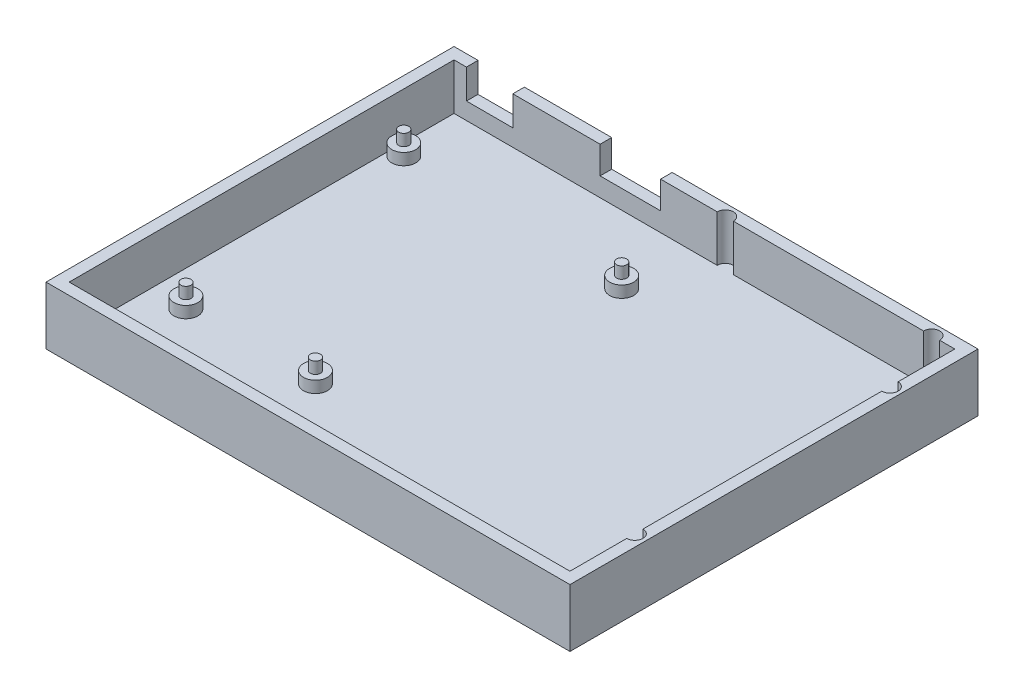
ISO-10303-21;
HEADER;
FILE_DESCRIPTION(('STEP AP214'),'2;1');
FILE_NAME('part.step','',(''),(''),'','','');
FILE_SCHEMA(('AUTOMOTIVE_DESIGN { 1 0 10303 214 1 1 1 1 }'));
ENDSEC;
DATA;
#1=APPLICATION_CONTEXT('core data for automotive mechanical design processes');
#2=APPLICATION_PROTOCOL_DEFINITION('international standard','automotive_design',2000,#1);
#3=PRODUCT_CONTEXT('',#1,'mechanical');
#4=PRODUCT('Part','Part','',(#3));
#5=PRODUCT_RELATED_PRODUCT_CATEGORY('part','',(#4));
#6=PRODUCT_DEFINITION_FORMATION('','',#4);
#7=PRODUCT_DEFINITION_CONTEXT('part definition',#1,'design');
#8=PRODUCT_DEFINITION('design','',#6,#7);
#9=PRODUCT_DEFINITION_SHAPE('','',#8);
#10=(LENGTH_UNIT() NAMED_UNIT(*) SI_UNIT(.MILLI.,.METRE.));
#11=(NAMED_UNIT(*) PLANE_ANGLE_UNIT() SI_UNIT($,.RADIAN.));
#12=(NAMED_UNIT(*) SI_UNIT($,.STERADIAN.) SOLID_ANGLE_UNIT());
#13=UNCERTAINTY_MEASURE_WITH_UNIT(LENGTH_MEASURE(1.E-05),#10,'distance_accuracy_value','');
#14=(GEOMETRIC_REPRESENTATION_CONTEXT(3) GLOBAL_UNCERTAINTY_ASSIGNED_CONTEXT((#13)) GLOBAL_UNIT_ASSIGNED_CONTEXT((#10,
#11,#12)) REPRESENTATION_CONTEXT('',''));
#15=CARTESIAN_POINT('',(0.,0.,0.));
#16=DIRECTION('',(0.,0.,1.));
#17=DIRECTION('',(1.,0.,0.));
#18=AXIS2_PLACEMENT_3D('',#15,#16,#17);
#19=CARTESIAN_POINT('',(108.,165.723601407031,0.));
#20=DIRECTION('',(-1.,0.,0.));
#21=DIRECTION('',(0.,0.,1.));
#22=AXIS2_PLACEMENT_3D('',#19,#20,#21);
#23=PLANE('',#22);
#24=DIRECTION('',(0.,1.,0.));
#25=VECTOR('',#24,1.);
#26=CARTESIAN_POINT('',(108.,-1.41311896062464,-12.25));
#27=LINE('',#26,#25);
#28=CARTESIAN_POINT('',(108.,2.5,-12.25));
#29=VERTEX_POINT('',#28);
#30=CARTESIAN_POINT('',(108.,12.5,-12.25));
#31=VERTEX_POINT('',#30);
#32=EDGE_CURVE('E466',#29,#31,#27,.T.);
#33=ORIENTED_EDGE('',*,*,#32,.F.);
#34=DIRECTION('',(0.,0.,-1.));
#35=VECTOR('',#34,1.);
#36=CARTESIAN_POINT('',(108.,2.5,0.));
#37=LINE('',#36,#35);
#38=CARTESIAN_POINT('',(108.,2.5,0.));
#39=VERTEX_POINT('',#38);
#40=EDGE_CURVE('E247',#39,#29,#37,.T.);
#41=ORIENTED_EDGE('',*,*,#40,.F.);
#42=DIRECTION('',(0.,-1.,0.));
#43=VECTOR('',#42,1.);
#44=CARTESIAN_POINT('',(108.,165.723601407031,0.));
#45=LINE('',#44,#43);
#46=CARTESIAN_POINT('',(108.,12.5,0.));
#47=VERTEX_POINT('',#46);
#48=EDGE_CURVE('E377',#47,#39,#45,.T.);
#49=ORIENTED_EDGE('',*,*,#48,.F.);
#50=DIRECTION('',(0.,0.,1.));
#51=VECTOR('',#50,1.);
#52=CARTESIAN_POINT('',(108.,12.5,0.));
#53=LINE('',#52,#51);
#54=EDGE_CURVE('E389',#31,#47,#53,.T.);
#55=ORIENTED_EDGE('',*,*,#54,.F.);
#56=EDGE_LOOP('',(#33,#41,#49,#55));
#57=FACE_BOUND('',#56,.T.);
#58=ADVANCED_FACE('F38',(#57),#23,.T.);
#59=DIRECTION('',(0.,1.,0.));
#60=VECTOR('',#59,1.);
#61=CARTESIAN_POINT('',(108.,-1.41311896062464,-15.75));
#62=LINE('',#61,#60);
#63=CARTESIAN_POINT('',(108.,2.5,-15.75));
#64=VERTEX_POINT('',#63);
#65=CARTESIAN_POINT('',(108.,12.5,-15.75));
#66=VERTEX_POINT('',#65);
#67=EDGE_CURVE('E456',#64,#66,#62,.T.);
#68=ORIENTED_EDGE('',*,*,#67,.T.);
#69=CARTESIAN_POINT('',(108.,12.5,-67.25));
#70=VERTEX_POINT('',#69);
#71=EDGE_CURVE('E397',#70,#66,#53,.T.);
#72=ORIENTED_EDGE('',*,*,#71,.F.);
#73=DIRECTION('',(0.,1.,0.));
#74=VECTOR('',#73,1.);
#75=CARTESIAN_POINT('',(108.,-1.41311896062464,-67.25));
#76=LINE('',#75,#74);
#77=CARTESIAN_POINT('',(108.,2.5,-67.25));
#78=VERTEX_POINT('',#77);
#79=EDGE_CURVE('E455',#78,#70,#76,.T.);
#80=ORIENTED_EDGE('',*,*,#79,.F.);
#81=EDGE_CURVE('E251',#64,#78,#37,.T.);
#82=ORIENTED_EDGE('',*,*,#81,.F.);
#83=EDGE_LOOP('',(#68,#72,#80,#82));
#84=FACE_BOUND('',#83,.T.);
#85=ADVANCED_FACE('F495',(#84),#23,.T.);
#86=CARTESIAN_POINT('',(0.,165.723601407031,-83.));
#87=DIRECTION('',(0.,0.,-1.));
#88=DIRECTION('',(-1.,0.,0.));
#89=AXIS2_PLACEMENT_3D('',#86,#87,#88);
#90=PLANE('',#89);
#91=DIRECTION('',(1.,0.,0.));
#92=VECTOR('',#91,1.);
#93=CARTESIAN_POINT('',(0.,2.5,-83.));
#94=LINE('',#93,#92);
#95=CARTESIAN_POINT('',(0.,2.5,-83.));
#96=VERTEX_POINT('',#95);
#97=CARTESIAN_POINT('',(56.75,2.5,-83.));
#98=VERTEX_POINT('',#97);
#99=EDGE_CURVE('E232',#96,#98,#94,.T.);
#100=ORIENTED_EDGE('',*,*,#99,.T.);
#101=DIRECTION('',(0.,1.,0.));
#102=VECTOR('',#101,1.);
#103=CARTESIAN_POINT('',(56.75,-1.41311896062464,-83.));
#104=LINE('',#103,#102);
#105=CARTESIAN_POINT('',(56.75,12.5,-83.));
#106=VERTEX_POINT('',#105);
#107=EDGE_CURVE('E63',#98,#106,#104,.T.);
#108=ORIENTED_EDGE('',*,*,#107,.T.);
#109=DIRECTION('',(-1.,0.,0.));
#110=VECTOR('',#109,1.);
#111=CARTESIAN_POINT('',(0.,12.5,-83.));
#112=LINE('',#111,#110);
#113=CARTESIAN_POINT('',(44.5399999999999,12.5,-83.));
#114=VERTEX_POINT('',#113);
#115=EDGE_CURVE('E404',#106,#114,#112,.T.);
#116=ORIENTED_EDGE('',*,*,#115,.T.);
#117=DIRECTION('',(0.,1.,0.));
#118=VECTOR('',#117,1.);
#119=CARTESIAN_POINT('',(44.5399999999999,12.5,-83.));
#120=LINE('',#119,#118);
#121=CARTESIAN_POINT('',(44.5399999999999,6.58000000000003,-83.));
#122=VERTEX_POINT('',#121);
#123=EDGE_CURVE('E351',#122,#114,#120,.T.);
#124=ORIENTED_EDGE('',*,*,#123,.F.);
#125=DIRECTION('',(1.,0.,0.));
#126=VECTOR('',#125,1.);
#127=CARTESIAN_POINT('',(44.5399999999999,6.58000000000003,-83.));
#128=LINE('',#127,#126);
#129=CARTESIAN_POINT('',(31.4999999999999,6.58000000000003,-83.));
#130=VERTEX_POINT('',#129);
#131=EDGE_CURVE('E354',#130,#122,#128,.T.);
#132=ORIENTED_EDGE('',*,*,#131,.F.);
#133=DIRECTION('',(0.,-1.,0.));
#134=VECTOR('',#133,1.);
#135=CARTESIAN_POINT('',(31.4999999999999,6.58000000000003,-83.));
#136=LINE('',#135,#134);
#137=CARTESIAN_POINT('',(31.4999999999999,12.5,-83.));
#138=VERTEX_POINT('',#137);
#139=EDGE_CURVE('E336',#138,#130,#136,.T.);
#140=ORIENTED_EDGE('',*,*,#139,.F.);
#141=CARTESIAN_POINT('',(12.6749999999999,12.5,-83.));
#142=VERTEX_POINT('',#141);
#143=EDGE_CURVE('E405',#138,#142,#112,.T.);
#144=ORIENTED_EDGE('',*,*,#143,.T.);
#145=DIRECTION('',(0.,1.,0.));
#146=VECTOR('',#145,1.);
#147=CARTESIAN_POINT('',(12.6749999999999,12.5,-83.));
#148=LINE('',#147,#146);
#149=CARTESIAN_POINT('',(12.6749999999999,6.15000000000005,-83.));
#150=VERTEX_POINT('',#149);
#151=EDGE_CURVE('E331',#150,#142,#148,.T.);
#152=ORIENTED_EDGE('',*,*,#151,.F.);
#153=DIRECTION('',(1.,0.,0.));
#154=VECTOR('',#153,1.);
#155=CARTESIAN_POINT('',(12.6749999999999,6.15000000000005,-83.));
#156=LINE('',#155,#154);
#157=CARTESIAN_POINT('',(2.67499999999987,6.15000000000005,-83.));
#158=VERTEX_POINT('',#157);
#159=EDGE_CURVE('E326',#158,#150,#156,.T.);
#160=ORIENTED_EDGE('',*,*,#159,.F.);
#161=DIRECTION('',(0.,-1.,0.));
#162=VECTOR('',#161,1.);
#163=CARTESIAN_POINT('',(2.67499999999987,6.15000000000005,-83.));
#164=LINE('',#163,#162);
#165=CARTESIAN_POINT('',(2.67499999999987,12.5,-83.));
#166=VERTEX_POINT('',#165);
#167=EDGE_CURVE('E328',#166,#158,#164,.T.);
#168=ORIENTED_EDGE('',*,*,#167,.F.);
#169=CARTESIAN_POINT('',(0.,12.5,-83.));
#170=VERTEX_POINT('',#169);
#171=EDGE_CURVE('E385',#166,#170,#112,.T.);
#172=ORIENTED_EDGE('',*,*,#171,.T.);
#173=DIRECTION('',(0.,-1.,0.));
#174=VECTOR('',#173,1.);
#175=CARTESIAN_POINT('',(0.,165.723601407031,-83.));
#176=LINE('',#175,#174);
#177=EDGE_CURVE('E386',#170,#96,#176,.T.);
#178=ORIENTED_EDGE('',*,*,#177,.T.);
#179=EDGE_LOOP('',(#100,#108,#116,#124,#132,#140,#144,#152,#160,#168,#172,#178));
#180=FACE_BOUND('',#179,.T.);
#181=ADVANCED_FACE('F440',(#180),#90,.F.);
#182=CARTESIAN_POINT('',(101.25,12.5,-83.));
#183=VERTEX_POINT('',#182);
#184=CARTESIAN_POINT('',(60.25,12.5,-83.));
#185=VERTEX_POINT('',#184);
#186=EDGE_CURVE('E225',#183,#185,#112,.T.);
#187=ORIENTED_EDGE('',*,*,#186,.T.);
#188=DIRECTION('',(0.,1.,0.));
#189=VECTOR('',#188,1.);
#190=CARTESIAN_POINT('',(60.25,-1.41311896062464,-83.));
#191=LINE('',#190,#189);
#192=CARTESIAN_POINT('',(60.25,2.5,-83.));
#193=VERTEX_POINT('',#192);
#194=EDGE_CURVE('E212',#193,#185,#191,.T.);
#195=ORIENTED_EDGE('',*,*,#194,.F.);
#196=CARTESIAN_POINT('',(101.25,2.5,-83.));
#197=VERTEX_POINT('',#196);
#198=EDGE_CURVE('E223',#193,#197,#94,.T.);
#199=ORIENTED_EDGE('',*,*,#198,.T.);
#200=DIRECTION('',(0.,1.,0.));
#201=VECTOR('',#200,1.);
#202=CARTESIAN_POINT('',(101.25,-1.41311896062464,-83.));
#203=LINE('',#202,#201);
#204=EDGE_CURVE('E55',#197,#183,#203,.T.);
#205=ORIENTED_EDGE('',*,*,#204,.T.);
#206=EDGE_LOOP('',(#187,#195,#199,#205));
#207=FACE_BOUND('',#206,.T.);
#208=ADVANCED_FACE('F222',(#207),#90,.F.);
#209=CARTESIAN_POINT('',(0.,165.723601407031,0.));
#210=DIRECTION('',(-1.,0.,0.));
#211=DIRECTION('',(0.,0.,1.));
#212=AXIS2_PLACEMENT_3D('',#209,#210,#211);
#213=PLANE('',#212);
#214=DIRECTION('',(0.,-1.,0.));
#215=VECTOR('',#214,1.);
#216=CARTESIAN_POINT('',(0.,5.,-70.118514184194));
#217=LINE('',#216,#215);
#218=CARTESIAN_POINT('',(0.,2.5,-70.118514184194));
#219=VERTEX_POINT('',#218);
#220=CARTESIAN_POINT('',(0.,5.,-70.118514184194));
#221=VERTEX_POINT('',#220);
#222=EDGE_CURVE('E313',#219,#221,#217,.F.);
#223=ORIENTED_EDGE('',*,*,#222,.F.);
#224=DIRECTION('',(0.,0.,-1.));
#225=VECTOR('',#224,1.);
#226=CARTESIAN_POINT('',(0.,2.5,0.));
#227=LINE('',#226,#225);
#228=EDGE_CURVE('E235',#219,#96,#227,.T.);
#229=ORIENTED_EDGE('',*,*,#228,.T.);
#230=ORIENTED_EDGE('',*,*,#177,.F.);
#231=DIRECTION('',(0.,0.,1.));
#232=VECTOR('',#231,1.);
#233=CARTESIAN_POINT('',(0.,12.5,0.));
#234=LINE('',#233,#232);
#235=CARTESIAN_POINT('',(0.,12.5,0.));
#236=VERTEX_POINT('',#235);
#237=EDGE_CURVE('E380',#170,#236,#234,.T.);
#238=ORIENTED_EDGE('',*,*,#237,.T.);
#239=DIRECTION('',(0.,-1.,0.));
#240=VECTOR('',#239,1.);
#241=CARTESIAN_POINT('',(0.,165.723601407031,0.));
#242=LINE('',#241,#240);
#243=CARTESIAN_POINT('',(0.,2.5,0.));
#244=VERTEX_POINT('',#243);
#245=EDGE_CURVE('E382',#236,#244,#242,.T.);
#246=ORIENTED_EDGE('',*,*,#245,.T.);
#247=CARTESIAN_POINT('',(0.,2.5,-69.1314858158061));
#248=VERTEX_POINT('',#247);
#249=EDGE_CURVE('E241',#244,#248,#227,.T.);
#250=ORIENTED_EDGE('',*,*,#249,.T.);
#251=DIRECTION('',(0.,-1.,0.));
#252=VECTOR('',#251,1.);
#253=CARTESIAN_POINT('',(0.,5.,-69.1314858158061));
#254=LINE('',#253,#252);
#255=CARTESIAN_POINT('',(0.,5.,-69.1314858158061));
#256=VERTEX_POINT('',#255);
#257=EDGE_CURVE('E310',#256,#248,#254,.T.);
#258=ORIENTED_EDGE('',*,*,#257,.F.);
#259=DIRECTION('',(0.,0.,-1.));
#260=VECTOR('',#259,1.);
#261=CARTESIAN_POINT('',(0.,5.,0.));
#262=LINE('',#261,#260);
#263=EDGE_CURVE('E12',#256,#221,#262,.T.);
#264=ORIENTED_EDGE('',*,*,#263,.T.);
#265=EDGE_LOOP('',(#223,#229,#230,#238,#246,#250,#258,#264));
#266=FACE_BOUND('',#265,.T.);
#267=ADVANCED_FACE('F447',(#266),#213,.F.);
#268=CARTESIAN_POINT('',(0.,12.5,0.));
#269=DIRECTION('',(0.,-1.,0.));
#270=DIRECTION('',(0.,0.,-1.));
#271=AXIS2_PLACEMENT_3D('',#268,#269,#270);
#272=PLANE('',#271);
#273=ORIENTED_EDGE('',*,*,#71,.T.);
#274=CARTESIAN_POINT('',(108.,12.5,-14.));
#275=DIRECTION('',(0.,1.,0.));
#276=DIRECTION('',(0.,0.,-1.));
#277=AXIS2_PLACEMENT_3D('',#274,#275,#276);
#278=CIRCLE('',#277,1.75);
#279=EDGE_CURVE('E464',#31,#66,#278,.T.);
#280=ORIENTED_EDGE('',*,*,#279,.F.);
#281=ORIENTED_EDGE('',*,*,#54,.T.);
#282=DIRECTION('',(-1.,0.,0.));
#283=VECTOR('',#282,1.);
#284=CARTESIAN_POINT('',(0.,12.5,0.));
#285=LINE('',#284,#283);
#286=EDGE_CURVE('E396',#47,#236,#285,.T.);
#287=ORIENTED_EDGE('',*,*,#286,.T.);
#288=ORIENTED_EDGE('',*,*,#237,.F.);
#289=ORIENTED_EDGE('',*,*,#171,.F.);
#290=DIRECTION('',(0.,0.,-1.));
#291=VECTOR('',#290,1.);
#292=CARTESIAN_POINT('',(2.67499999999987,12.5,-68.6791061731469));
#293=LINE('',#292,#291);
#294=CARTESIAN_POINT('',(2.67499999999987,12.5,-85.5));
#295=VERTEX_POINT('',#294);
#296=EDGE_CURVE('E329',#166,#295,#293,.T.);
#297=ORIENTED_EDGE('',*,*,#296,.T.);
#298=DIRECTION('',(-1.,0.,0.));
#299=VECTOR('',#298,1.);
#300=CARTESIAN_POINT('',(0.,12.5,-85.5));
#301=LINE('',#300,#299);
#302=CARTESIAN_POINT('',(-2.5,12.5,-85.5));
#303=VERTEX_POINT('',#302);
#304=EDGE_CURVE('E376',#295,#303,#301,.T.);
#305=ORIENTED_EDGE('',*,*,#304,.T.);
#306=DIRECTION('',(0.,0.,1.));
#307=VECTOR('',#306,1.);
#308=CARTESIAN_POINT('',(-2.5,12.5,0.));
#309=LINE('',#308,#307);
#310=CARTESIAN_POINT('',(-2.5,12.5,2.5));
#311=VERTEX_POINT('',#310);
#312=EDGE_CURVE('E399',#303,#311,#309,.T.);
#313=ORIENTED_EDGE('',*,*,#312,.T.);
#314=DIRECTION('',(-1.,0.,0.));
#315=VECTOR('',#314,1.);
#316=CARTESIAN_POINT('',(0.,12.5,2.5));
#317=LINE('',#316,#315);
#318=CARTESIAN_POINT('',(110.5,12.5,2.5));
#319=VERTEX_POINT('',#318);
#320=EDGE_CURVE('E350',#319,#311,#317,.T.);
#321=ORIENTED_EDGE('',*,*,#320,.F.);
#322=DIRECTION('',(0.,0.,1.));
#323=VECTOR('',#322,1.);
#324=CARTESIAN_POINT('',(110.5,12.5,0.));
#325=LINE('',#324,#323);
#326=CARTESIAN_POINT('',(110.5,12.5,-85.5));
#327=VERTEX_POINT('',#326);
#328=EDGE_CURVE('E239',#327,#319,#325,.T.);
#329=ORIENTED_EDGE('',*,*,#328,.F.);
#330=CARTESIAN_POINT('',(44.5399999999999,12.5,-85.5));
#331=VERTEX_POINT('',#330);
#332=EDGE_CURVE('E236',#327,#331,#301,.T.);
#333=ORIENTED_EDGE('',*,*,#332,.T.);
#334=DIRECTION('',(0.,0.,-1.));
#335=VECTOR('',#334,1.);
#336=CARTESIAN_POINT('',(44.5399999999999,12.5,-68.6791061731469));
#337=LINE('',#336,#335);
#338=EDGE_CURVE('E366',#114,#331,#337,.T.);
#339=ORIENTED_EDGE('',*,*,#338,.F.);
#340=ORIENTED_EDGE('',*,*,#115,.F.);
#341=CARTESIAN_POINT('',(58.5,12.5,-83.));
#342=DIRECTION('',(0.,1.,0.));
#343=DIRECTION('',(0.,0.,-1.));
#344=AXIS2_PLACEMENT_3D('',#341,#342,#343);
#345=CIRCLE('',#344,1.75);
#346=EDGE_CURVE('E226',#185,#106,#345,.T.);
#347=ORIENTED_EDGE('',*,*,#346,.F.);
#348=ORIENTED_EDGE('',*,*,#186,.F.);
#349=CARTESIAN_POINT('',(103.,12.5,-83.));
#350=DIRECTION('',(0.,1.,0.));
#351=DIRECTION('',(0.,0.,-1.));
#352=AXIS2_PLACEMENT_3D('',#349,#350,#351);
#353=CIRCLE('',#352,1.75);
#354=CARTESIAN_POINT('',(104.75,12.5,-83.));
#355=VERTEX_POINT('',#354);
#356=EDGE_CURVE('E448',#355,#183,#353,.T.);
#357=ORIENTED_EDGE('',*,*,#356,.F.);
#358=CARTESIAN_POINT('',(108.,12.5,-83.));
#359=VERTEX_POINT('',#358);
#360=EDGE_CURVE('E390',#359,#355,#112,.T.);
#361=ORIENTED_EDGE('',*,*,#360,.F.);
#362=CARTESIAN_POINT('',(108.,12.5,-70.75));
#363=VERTEX_POINT('',#362);
#364=EDGE_CURVE('E393',#359,#363,#53,.T.);
#365=ORIENTED_EDGE('',*,*,#364,.T.);
#366=CARTESIAN_POINT('',(108.,12.5,-69.));
#367=DIRECTION('',(0.,1.,0.));
#368=DIRECTION('',(0.,0.,-1.));
#369=AXIS2_PLACEMENT_3D('',#366,#367,#368);
#370=CIRCLE('',#369,1.75);
#371=EDGE_CURVE('E453',#70,#363,#370,.T.);
#372=ORIENTED_EDGE('',*,*,#371,.F.);
#373=EDGE_LOOP('',(#273,#280,#281,#287,#288,#289,#297,#305,#313,#321,#329,#333,#339,#340,#347,
#348,#357,#361,#365,#372));
#374=FACE_BOUND('',#373,.T.);
#375=ADVANCED_FACE('F418',(#374),#272,.F.);
#376=CARTESIAN_POINT('',(-2.5,2.5,2.5));
#377=DIRECTION('',(-1.,0.,0.));
#378=DIRECTION('',(0.,0.,1.));
#379=AXIS2_PLACEMENT_3D('',#376,#377,#378);
#380=PLANE('',#379);
#381=DIRECTION('',(0.,0.,-1.));
#382=VECTOR('',#381,1.);
#383=CARTESIAN_POINT('',(-2.5,0.,2.5));
#384=LINE('',#383,#382);
#385=CARTESIAN_POINT('',(-2.5,0.,2.5));
#386=VERTEX_POINT('',#385);
#387=CARTESIAN_POINT('',(-2.5,0.,-85.5));
#388=VERTEX_POINT('',#387);
#389=EDGE_CURVE('E250',#386,#388,#384,.T.);
#390=ORIENTED_EDGE('',*,*,#389,.F.);
#391=DIRECTION('',(0.,-1.,0.));
#392=VECTOR('',#391,1.);
#393=CARTESIAN_POINT('',(-2.5,2.5,2.5));
#394=LINE('',#393,#392);
#395=EDGE_CURVE('E263',#311,#386,#394,.T.);
#396=ORIENTED_EDGE('',*,*,#395,.F.);
#397=ORIENTED_EDGE('',*,*,#312,.F.);
#398=DIRECTION('',(0.,-1.,0.));
#399=VECTOR('',#398,1.);
#400=CARTESIAN_POINT('',(-2.5,2.5,-85.5));
#401=LINE('',#400,#399);
#402=EDGE_CURVE('E262',#303,#388,#401,.T.);
#403=ORIENTED_EDGE('',*,*,#402,.T.);
#404=EDGE_LOOP('',(#390,#396,#397,#403));
#405=FACE_BOUND('',#404,.T.);
#406=ADVANCED_FACE('F40',(#405),#380,.T.);
#407=CARTESIAN_POINT('',(-2.5,2.5,2.5));
#408=DIRECTION('',(0.,0.,-1.));
#409=DIRECTION('',(-1.,0.,0.));
#410=AXIS2_PLACEMENT_3D('',#407,#408,#409);
#411=PLANE('',#410);
#412=DIRECTION('',(1.,0.,0.));
#413=VECTOR('',#412,1.);
#414=CARTESIAN_POINT('',(-2.5,0.,2.5));
#415=LINE('',#414,#413);
#416=CARTESIAN_POINT('',(110.5,0.,2.5));
#417=VERTEX_POINT('',#416);
#418=EDGE_CURVE('E260',#386,#417,#415,.T.);
#419=ORIENTED_EDGE('',*,*,#418,.T.);
#420=DIRECTION('',(0.,-1.,0.));
#421=VECTOR('',#420,1.);
#422=CARTESIAN_POINT('',(110.5,2.5,2.5));
#423=LINE('',#422,#421);
#424=EDGE_CURVE('E266',#319,#417,#423,.T.);
#425=ORIENTED_EDGE('',*,*,#424,.F.);
#426=ORIENTED_EDGE('',*,*,#320,.T.);
#427=ORIENTED_EDGE('',*,*,#395,.T.);
#428=EDGE_LOOP('',(#419,#425,#426,#427));
#429=FACE_BOUND('',#428,.T.);
#430=ADVANCED_FACE('F833',(#429),#411,.F.);
#431=CARTESIAN_POINT('',(110.5,2.5,2.5));
#432=DIRECTION('',(-1.,0.,0.));
#433=DIRECTION('',(0.,0.,1.));
#434=AXIS2_PLACEMENT_3D('',#431,#432,#433);
#435=PLANE('',#434);
#436=DIRECTION('',(0.,0.,-1.));
#437=VECTOR('',#436,1.);
#438=CARTESIAN_POINT('',(110.5,0.,2.5));
#439=LINE('',#438,#437);
#440=CARTESIAN_POINT('',(110.5,0.,-85.5));
#441=VERTEX_POINT('',#440);
#442=EDGE_CURVE('E257',#417,#441,#439,.T.);
#443=ORIENTED_EDGE('',*,*,#442,.T.);
#444=DIRECTION('',(0.,-1.,0.));
#445=VECTOR('',#444,1.);
#446=CARTESIAN_POINT('',(110.5,2.5,-85.5));
#447=LINE('',#446,#445);
#448=EDGE_CURVE('E269',#327,#441,#447,.T.);
#449=ORIENTED_EDGE('',*,*,#448,.F.);
#450=ORIENTED_EDGE('',*,*,#328,.T.);
#451=ORIENTED_EDGE('',*,*,#424,.T.);
#452=EDGE_LOOP('',(#443,#449,#450,#451));
#453=FACE_BOUND('',#452,.T.);
#454=ADVANCED_FACE('F413',(#453),#435,.F.);
#455=CARTESIAN_POINT('',(-2.5,2.5,-85.5));
#456=DIRECTION('',(0.,0.,-1.));
#457=DIRECTION('',(-1.,0.,0.));
#458=AXIS2_PLACEMENT_3D('',#455,#456,#457);
#459=PLANE('',#458);
#460=DIRECTION('',(0.,1.,0.));
#461=VECTOR('',#460,1.);
#462=CARTESIAN_POINT('',(2.67499999999987,6.15000000000005,-85.5));
#463=LINE('',#462,#461);
#464=CARTESIAN_POINT('',(2.67499999999987,6.15000000000005,-85.5));
#465=VERTEX_POINT('',#464);
#466=EDGE_CURVE('E339',#465,#295,#463,.T.);
#467=ORIENTED_EDGE('',*,*,#466,.F.);
#468=DIRECTION('',(-1.,0.,0.));
#469=VECTOR('',#468,1.);
#470=CARTESIAN_POINT('',(12.6749999999999,6.15000000000005,-85.5));
#471=LINE('',#470,#469);
#472=CARTESIAN_POINT('',(12.6749999999999,6.15000000000005,-85.5));
#473=VERTEX_POINT('',#472);
#474=EDGE_CURVE('E335',#473,#465,#471,.T.);
#475=ORIENTED_EDGE('',*,*,#474,.F.);
#476=DIRECTION('',(0.,-1.,0.));
#477=VECTOR('',#476,1.);
#478=CARTESIAN_POINT('',(12.6749999999999,12.5,-85.5));
#479=LINE('',#478,#477);
#480=CARTESIAN_POINT('',(12.6749999999999,12.5,-85.5));
#481=VERTEX_POINT('',#480);
#482=EDGE_CURVE('E332',#481,#473,#479,.T.);
#483=ORIENTED_EDGE('',*,*,#482,.F.);
#484=CARTESIAN_POINT('',(31.4999999999999,12.5,-85.5));
#485=VERTEX_POINT('',#484);
#486=EDGE_CURVE('E375',#485,#481,#301,.T.);
#487=ORIENTED_EDGE('',*,*,#486,.F.);
#488=DIRECTION('',(0.,1.,0.));
#489=VECTOR('',#488,1.);
#490=CARTESIAN_POINT('',(31.4999999999999,6.58000000000003,-85.5));
#491=LINE('',#490,#489);
#492=CARTESIAN_POINT('',(31.4999999999999,6.58000000000003,-85.5));
#493=VERTEX_POINT('',#492);
#494=EDGE_CURVE('E359',#493,#485,#491,.T.);
#495=ORIENTED_EDGE('',*,*,#494,.F.);
#496=DIRECTION('',(-1.,0.,0.));
#497=VECTOR('',#496,1.);
#498=CARTESIAN_POINT('',(44.5399999999999,6.58000000000003,-85.5));
#499=LINE('',#498,#497);
#500=CARTESIAN_POINT('',(44.5399999999999,6.58000000000003,-85.5));
#501=VERTEX_POINT('',#500);
#502=EDGE_CURVE('E325',#501,#493,#499,.T.);
#503=ORIENTED_EDGE('',*,*,#502,.F.);
#504=DIRECTION('',(0.,-1.,0.));
#505=VECTOR('',#504,1.);
#506=CARTESIAN_POINT('',(44.5399999999999,12.5,-85.5));
#507=LINE('',#506,#505);
#508=EDGE_CURVE('E361',#331,#501,#507,.T.);
#509=ORIENTED_EDGE('',*,*,#508,.F.);
#510=ORIENTED_EDGE('',*,*,#332,.F.);
#511=ORIENTED_EDGE('',*,*,#448,.T.);
#512=DIRECTION('',(1.,0.,0.));
#513=VECTOR('',#512,1.);
#514=CARTESIAN_POINT('',(-2.5,0.,-85.5));
#515=LINE('',#514,#513);
#516=EDGE_CURVE('E254',#388,#441,#515,.T.);
#517=ORIENTED_EDGE('',*,*,#516,.F.);
#518=ORIENTED_EDGE('',*,*,#402,.F.);
#519=ORIENTED_EDGE('',*,*,#304,.F.);
#520=EDGE_LOOP('',(#467,#475,#483,#487,#495,#503,#509,#510,#511,#517,#518,#519));
#521=FACE_BOUND('',#520,.T.);
#522=ADVANCED_FACE('F423',(#521),#459,.T.);
#523=CARTESIAN_POINT('',(0.,0.,0.));
#524=DIRECTION('',(0.,-1.,0.));
#525=DIRECTION('',(0.,0.,-1.));
#526=AXIS2_PLACEMENT_3D('',#523,#524,#525);
#527=PLANE('',#526);
#528=ORIENTED_EDGE('',*,*,#389,.T.);
#529=ORIENTED_EDGE('',*,*,#516,.T.);
#530=ORIENTED_EDGE('',*,*,#442,.F.);
#531=ORIENTED_EDGE('',*,*,#418,.F.);
#532=EDGE_LOOP('',(#528,#529,#530,#531));
#533=FACE_BOUND('',#532,.T.);
#534=ADVANCED_FACE('F508',(#533),#527,.T.);
#535=DIRECTION('',(0.,1.,0.));
#536=VECTOR('',#535,1.);
#537=CARTESIAN_POINT('',(108.,-1.41311896062464,-70.75));
#538=LINE('',#537,#536);
#539=CARTESIAN_POINT('',(108.,2.5,-70.75));
#540=VERTEX_POINT('',#539);
#541=EDGE_CURVE('E460',#540,#363,#538,.T.);
#542=ORIENTED_EDGE('',*,*,#541,.T.);
#543=ORIENTED_EDGE('',*,*,#364,.F.);
#544=DIRECTION('',(0.,-1.,0.));
#545=VECTOR('',#544,1.);
#546=CARTESIAN_POINT('',(108.,165.723601407031,-83.));
#547=LINE('',#546,#545);
#548=CARTESIAN_POINT('',(108.,2.5,-83.));
#549=VERTEX_POINT('',#548);
#550=EDGE_CURVE('E381',#359,#549,#547,.T.);
#551=ORIENTED_EDGE('',*,*,#550,.T.);
#552=EDGE_CURVE('E246',#540,#549,#37,.T.);
#553=ORIENTED_EDGE('',*,*,#552,.F.);
#554=EDGE_LOOP('',(#542,#543,#551,#553));
#555=FACE_BOUND('',#554,.T.);
#556=ADVANCED_FACE('F498',(#555),#23,.T.);
#557=CARTESIAN_POINT('',(0.,165.723601407031,0.));
#558=DIRECTION('',(0.,0.,-1.));
#559=DIRECTION('',(-1.,0.,0.));
#560=AXIS2_PLACEMENT_3D('',#557,#558,#559);
#561=PLANE('',#560);
#562=DIRECTION('',(1.,0.,0.));
#563=VECTOR('',#562,1.);
#564=CARTESIAN_POINT('',(0.,2.5,0.));
#565=LINE('',#564,#563);
#566=EDGE_CURVE('E244',#244,#39,#565,.T.);
#567=ORIENTED_EDGE('',*,*,#566,.F.);
#568=ORIENTED_EDGE('',*,*,#245,.F.);
#569=ORIENTED_EDGE('',*,*,#286,.F.);
#570=ORIENTED_EDGE('',*,*,#48,.T.);
#571=EDGE_LOOP('',(#567,#568,#569,#570));
#572=FACE_BOUND('',#571,.T.);
#573=ADVANCED_FACE('F507',(#572),#561,.T.);
#574=ORIENTED_EDGE('',*,*,#360,.T.);
#575=DIRECTION('',(0.,1.,0.));
#576=VECTOR('',#575,1.);
#577=CARTESIAN_POINT('',(104.75,-1.41311896062464,-83.));
#578=LINE('',#577,#576);
#579=CARTESIAN_POINT('',(104.75,2.5,-83.));
#580=VERTEX_POINT('',#579);
#581=EDGE_CURVE('E450',#580,#355,#578,.T.);
#582=ORIENTED_EDGE('',*,*,#581,.F.);
#583=EDGE_CURVE('E233',#580,#549,#94,.T.);
#584=ORIENTED_EDGE('',*,*,#583,.T.);
#585=ORIENTED_EDGE('',*,*,#550,.F.);
#586=EDGE_LOOP('',(#574,#582,#584,#585));
#587=FACE_BOUND('',#586,.T.);
#588=ADVANCED_FACE('F514',(#587),#90,.F.);
#589=ORIENTED_EDGE('',*,*,#486,.T.);
#590=DIRECTION('',(0.,0.,-1.));
#591=VECTOR('',#590,1.);
#592=CARTESIAN_POINT('',(12.6749999999999,12.5,-68.6791061731469));
#593=LINE('',#592,#591);
#594=EDGE_CURVE('E341',#142,#481,#593,.T.);
#595=ORIENTED_EDGE('',*,*,#594,.F.);
#596=ORIENTED_EDGE('',*,*,#143,.F.);
#597=DIRECTION('',(0.,0.,-1.));
#598=VECTOR('',#597,1.);
#599=CARTESIAN_POINT('',(31.4999999999999,12.5,-68.6791061731469));
#600=LINE('',#599,#598);
#601=EDGE_CURVE('E368',#138,#485,#600,.T.);
#602=ORIENTED_EDGE('',*,*,#601,.T.);
#603=EDGE_LOOP('',(#589,#595,#596,#602));
#604=FACE_BOUND('',#603,.T.);
#605=ADVANCED_FACE('F575',(#604),#272,.F.);
#606=CARTESIAN_POINT('',(0.,2.5,0.));
#607=DIRECTION('',(0.,-1.,0.));
#608=DIRECTION('',(0.,0.,-1.));
#609=AXIS2_PLACEMENT_3D('',#606,#607,#608);
#610=PLANE('',#609);
#611=CARTESIAN_POINT('',(2.53999999999987,2.5,-69.625));
#612=DIRECTION('',(0.,-1.,0.));
#613=DIRECTION('',(0.,0.,-1.));
#614=AXIS2_PLACEMENT_3D('',#611,#612,#613);
#615=CIRCLE('',#614,2.58749999999999);
#616=EDGE_CURVE('E47',#248,#219,#615,.F.);
#617=ORIENTED_EDGE('',*,*,#616,.F.);
#618=ORIENTED_EDGE('',*,*,#249,.F.);
#619=ORIENTED_EDGE('',*,*,#566,.T.);
#620=ORIENTED_EDGE('',*,*,#40,.T.);
#621=CARTESIAN_POINT('',(108.,2.5,-14.));
#622=DIRECTION('',(0.,-1.,0.));
#623=DIRECTION('',(0.,0.,-1.));
#624=AXIS2_PLACEMENT_3D('',#621,#622,#623);
#625=CIRCLE('',#624,1.75);
#626=EDGE_CURVE('E467',#29,#64,#625,.F.);
#627=ORIENTED_EDGE('',*,*,#626,.T.);
#628=ORIENTED_EDGE('',*,*,#81,.T.);
#629=CARTESIAN_POINT('',(108.,2.5,-69.));
#630=DIRECTION('',(0.,-1.,0.));
#631=DIRECTION('',(0.,0.,-1.));
#632=AXIS2_PLACEMENT_3D('',#629,#630,#631);
#633=CIRCLE('',#632,1.75);
#634=EDGE_CURVE('E457',#78,#540,#633,.F.);
#635=ORIENTED_EDGE('',*,*,#634,.T.);
#636=ORIENTED_EDGE('',*,*,#552,.T.);
#637=ORIENTED_EDGE('',*,*,#583,.F.);
#638=CARTESIAN_POINT('',(103.,2.5,-83.));
#639=DIRECTION('',(0.,-1.,0.));
#640=DIRECTION('',(0.,0.,-1.));
#641=AXIS2_PLACEMENT_3D('',#638,#639,#640);
#642=CIRCLE('',#641,1.75);
#643=EDGE_CURVE('E231',#580,#197,#642,.F.);
#644=ORIENTED_EDGE('',*,*,#643,.T.);
#645=ORIENTED_EDGE('',*,*,#198,.F.);
#646=CARTESIAN_POINT('',(58.5,2.5,-83.));
#647=DIRECTION('',(0.,-1.,0.));
#648=DIRECTION('',(0.,0.,-1.));
#649=AXIS2_PLACEMENT_3D('',#646,#647,#648);
#650=CIRCLE('',#649,1.75);
#651=EDGE_CURVE('E209',#193,#98,#650,.F.);
#652=ORIENTED_EDGE('',*,*,#651,.T.);
#653=ORIENTED_EDGE('',*,*,#99,.F.);
#654=ORIENTED_EDGE('',*,*,#228,.F.);
#655=EDGE_LOOP('',(#617,#618,#619,#620,#627,#628,#635,#636,#637,#644,#645,#652,#653,#654));
#656=FACE_BOUND('',#655,.T.);
#657=CARTESIAN_POINT('',(50.7999999999999,2.5,-68.355));
#658=DIRECTION('',(0.,-1.,0.));
#659=DIRECTION('',(0.,0.,-1.));
#660=AXIS2_PLACEMENT_3D('',#657,#658,#659);
#661=CIRCLE('',#660,2.58750000000001);
#662=CARTESIAN_POINT('',(50.7999999999999,2.5,-70.9425));
#663=VERTEX_POINT('',#662);
#664=EDGE_CURVE('E277',#663,#663,#661,.F.);
#665=ORIENTED_EDGE('',*,*,#664,.F.);
#666=EDGE_LOOP('',(#665));
#667=FACE_BOUND('',#666,.T.);
#668=CARTESIAN_POINT('',(35.5599999999999,2.5,-17.555));
#669=DIRECTION('',(0.,-1.,0.));
#670=DIRECTION('',(0.,0.,-1.));
#671=AXIS2_PLACEMENT_3D('',#668,#669,#670);
#672=CIRCLE('',#671,2.58750000000001);
#673=CARTESIAN_POINT('',(35.5599999999999,2.5,-20.1425));
#674=VERTEX_POINT('',#673);
#675=EDGE_CURVE('E274',#674,#674,#672,.F.);
#676=ORIENTED_EDGE('',*,*,#675,.F.);
#677=EDGE_LOOP('',(#676));
#678=FACE_BOUND('',#677,.T.);
#679=CARTESIAN_POINT('',(7.61999999999987,2.5,-17.555));
#680=DIRECTION('',(0.,-1.,0.));
#681=DIRECTION('',(0.,0.,-1.));
#682=AXIS2_PLACEMENT_3D('',#679,#680,#681);
#683=CIRCLE('',#682,2.58750000000001);
#684=CARTESIAN_POINT('',(7.61999999999987,2.5,-20.1425));
#685=VERTEX_POINT('',#684);
#686=EDGE_CURVE('E265',#685,#685,#683,.F.);
#687=ORIENTED_EDGE('',*,*,#686,.F.);
#688=EDGE_LOOP('',(#687));
#689=FACE_BOUND('',#688,.T.);
#690=ADVANCED_FACE('F228',(#656,#667,#678,#689),#610,.F.);
#691=CARTESIAN_POINT('',(44.5399999999999,6.58000000000003,-68.6791061731469));
#692=DIRECTION('',(0.,-1.,0.));
#693=DIRECTION('',(0.,0.,-1.));
#694=AXIS2_PLACEMENT_3D('',#691,#692,#693);
#695=PLANE('',#694);
#696=ORIENTED_EDGE('',*,*,#131,.T.);
#697=DIRECTION('',(0.,0.,-1.));
#698=VECTOR('',#697,1.);
#699=CARTESIAN_POINT('',(44.5399999999999,6.58000000000003,-68.6791061731469));
#700=LINE('',#699,#698);
#701=EDGE_CURVE('E355',#122,#501,#700,.T.);
#702=ORIENTED_EDGE('',*,*,#701,.T.);
#703=ORIENTED_EDGE('',*,*,#502,.T.);
#704=DIRECTION('',(0.,0.,-1.));
#705=VECTOR('',#704,1.);
#706=CARTESIAN_POINT('',(31.4999999999999,6.58000000000003,-68.6791061731469));
#707=LINE('',#706,#705);
#708=EDGE_CURVE('E364',#130,#493,#707,.T.);
#709=ORIENTED_EDGE('',*,*,#708,.F.);
#710=EDGE_LOOP('',(#696,#702,#703,#709));
#711=FACE_BOUND('',#710,.T.);
#712=ADVANCED_FACE('F574',(#711),#695,.F.);
#713=CARTESIAN_POINT('',(44.5399999999999,12.5,-68.6791061731469));
#714=DIRECTION('',(1.,0.,0.));
#715=DIRECTION('',(0.,1.,0.));
#716=AXIS2_PLACEMENT_3D('',#713,#714,#715);
#717=PLANE('',#716);
#718=ORIENTED_EDGE('',*,*,#123,.T.);
#719=ORIENTED_EDGE('',*,*,#338,.T.);
#720=ORIENTED_EDGE('',*,*,#508,.T.);
#721=ORIENTED_EDGE('',*,*,#701,.F.);
#722=EDGE_LOOP('',(#718,#719,#720,#721));
#723=FACE_BOUND('',#722,.T.);
#724=ADVANCED_FACE('F429',(#723),#717,.F.);
#725=CARTESIAN_POINT('',(31.4999999999999,6.58000000000003,-68.6791061731469));
#726=DIRECTION('',(-1.,0.,0.));
#727=DIRECTION('',(0.,0.,1.));
#728=AXIS2_PLACEMENT_3D('',#725,#726,#727);
#729=PLANE('',#728);
#730=ORIENTED_EDGE('',*,*,#139,.T.);
#731=ORIENTED_EDGE('',*,*,#708,.T.);
#732=ORIENTED_EDGE('',*,*,#494,.T.);
#733=ORIENTED_EDGE('',*,*,#601,.F.);
#734=EDGE_LOOP('',(#730,#731,#732,#733));
#735=FACE_BOUND('',#734,.T.);
#736=ADVANCED_FACE('F765',(#735),#729,.F.);
#737=CARTESIAN_POINT('',(2.67499999999987,6.15000000000005,-68.6791061731469));
#738=DIRECTION('',(-1.,0.,0.));
#739=DIRECTION('',(0.,-1.,0.));
#740=AXIS2_PLACEMENT_3D('',#737,#738,#739);
#741=PLANE('',#740);
#742=ORIENTED_EDGE('',*,*,#167,.T.);
#743=DIRECTION('',(0.,0.,-1.));
#744=VECTOR('',#743,1.);
#745=CARTESIAN_POINT('',(2.67499999999987,6.15000000000005,-68.6791061731469));
#746=LINE('',#745,#744);
#747=EDGE_CURVE('E344',#158,#465,#746,.T.);
#748=ORIENTED_EDGE('',*,*,#747,.T.);
#749=ORIENTED_EDGE('',*,*,#466,.T.);
#750=ORIENTED_EDGE('',*,*,#296,.F.);
#751=EDGE_LOOP('',(#742,#748,#749,#750));
#752=FACE_BOUND('',#751,.T.);
#753=ADVANCED_FACE('F756',(#752),#741,.F.);
#754=CARTESIAN_POINT('',(12.6749999999999,6.15000000000005,-68.6791061731469));
#755=DIRECTION('',(0.,-1.,0.));
#756=DIRECTION('',(0.,0.,-1.));
#757=AXIS2_PLACEMENT_3D('',#754,#755,#756);
#758=PLANE('',#757);
#759=ORIENTED_EDGE('',*,*,#159,.T.);
#760=DIRECTION('',(0.,0.,-1.));
#761=VECTOR('',#760,1.);
#762=CARTESIAN_POINT('',(12.6749999999999,6.15000000000005,-68.6791061731469));
#763=LINE('',#762,#761);
#764=EDGE_CURVE('E346',#150,#473,#763,.T.);
#765=ORIENTED_EDGE('',*,*,#764,.T.);
#766=ORIENTED_EDGE('',*,*,#474,.T.);
#767=ORIENTED_EDGE('',*,*,#747,.F.);
#768=EDGE_LOOP('',(#759,#765,#766,#767));
#769=FACE_BOUND('',#768,.T.);
#770=ADVANCED_FACE('F747',(#769),#758,.F.);
#771=CARTESIAN_POINT('',(12.6749999999999,12.5,-68.6791061731469));
#772=DIRECTION('',(1.,0.,0.));
#773=DIRECTION('',(0.,1.,0.));
#774=AXIS2_PLACEMENT_3D('',#771,#772,#773);
#775=PLANE('',#774);
#776=ORIENTED_EDGE('',*,*,#151,.T.);
#777=ORIENTED_EDGE('',*,*,#594,.T.);
#778=ORIENTED_EDGE('',*,*,#482,.T.);
#779=ORIENTED_EDGE('',*,*,#764,.F.);
#780=EDGE_LOOP('',(#776,#777,#778,#779));
#781=FACE_BOUND('',#780,.T.);
#782=ADVANCED_FACE('F731',(#781),#775,.F.);
#783=CARTESIAN_POINT('',(7.61999999999987,5.,-17.555));
#784=DIRECTION('',(0.,-1.,0.));
#785=DIRECTION('',(0.,0.,-1.));
#786=AXIS2_PLACEMENT_3D('',#783,#784,#785);
#787=CYLINDRICAL_SURFACE('',#786,2.58750000000001);
#788=CARTESIAN_POINT('',(7.61999999999987,5.,-17.555));
#789=DIRECTION('',(0.,1.,0.));
#790=DIRECTION('',(0.,0.,1.));
#791=AXIS2_PLACEMENT_3D('',#788,#789,#790);
#792=CIRCLE('',#791,2.58750000000001);
#793=CARTESIAN_POINT('',(7.61999999999987,5.,-14.9675));
#794=VERTEX_POINT('',#793);
#795=EDGE_CURVE('E322',#794,#794,#792,.T.);
#796=ORIENTED_EDGE('',*,*,#795,.F.);
#797=EDGE_LOOP('',(#796));
#798=FACE_BOUND('',#797,.T.);
#799=ORIENTED_EDGE('',*,*,#686,.T.);
#800=EDGE_LOOP('',(#799));
#801=FACE_BOUND('',#800,.T.);
#802=ADVANCED_FACE('F723',(#798,#801),#787,.T.);
#803=CARTESIAN_POINT('',(7.61999999999987,5.,-17.555));
#804=DIRECTION('',(0.,1.,0.));
#805=DIRECTION('',(0.,0.,1.));
#806=AXIS2_PLACEMENT_3D('',#803,#804,#805);
#807=PLANE('',#806);
#808=CARTESIAN_POINT('',(7.61999999999987,5.,-17.555));
#809=DIRECTION('',(0.,1.,0.));
#810=DIRECTION('',(0.,0.,1.));
#811=AXIS2_PLACEMENT_3D('',#808,#809,#810);
#812=CIRCLE('',#811,1.08750000000001);
#813=CARTESIAN_POINT('',(7.61999999999987,5.,-16.4675));
#814=VERTEX_POINT('',#813);
#815=EDGE_CURVE('E282',#814,#814,#812,.F.);
#816=ORIENTED_EDGE('',*,*,#815,.T.);
#817=EDGE_LOOP('',(#816));
#818=FACE_BOUND('',#817,.T.);
#819=ORIENTED_EDGE('',*,*,#795,.T.);
#820=EDGE_LOOP('',(#819));
#821=FACE_BOUND('',#820,.T.);
#822=ADVANCED_FACE('F714',(#818,#821),#807,.T.);
#823=CARTESIAN_POINT('',(35.5599999999999,5.,-17.555));
#824=DIRECTION('',(0.,-1.,0.));
#825=DIRECTION('',(0.,0.,-1.));
#826=AXIS2_PLACEMENT_3D('',#823,#824,#825);
#827=CYLINDRICAL_SURFACE('',#826,2.58750000000001);
#828=CARTESIAN_POINT('',(35.5599999999999,5.,-17.555));
#829=DIRECTION('',(0.,1.,0.));
#830=DIRECTION('',(0.,0.,1.));
#831=AXIS2_PLACEMENT_3D('',#828,#829,#830);
#832=CIRCLE('',#831,2.58750000000001);
#833=CARTESIAN_POINT('',(35.5599999999999,5.,-14.9675));
#834=VERTEX_POINT('',#833);
#835=EDGE_CURVE('E319',#834,#834,#832,.T.);
#836=ORIENTED_EDGE('',*,*,#835,.F.);
#837=EDGE_LOOP('',(#836));
#838=FACE_BOUND('',#837,.T.);
#839=ORIENTED_EDGE('',*,*,#675,.T.);
#840=EDGE_LOOP('',(#839));
#841=FACE_BOUND('',#840,.T.);
#842=ADVANCED_FACE('F706',(#838,#841),#827,.T.);
#843=CARTESIAN_POINT('',(35.5599999999999,5.,-17.555));
#844=DIRECTION('',(0.,1.,0.));
#845=DIRECTION('',(0.,0.,1.));
#846=AXIS2_PLACEMENT_3D('',#843,#844,#845);
#847=PLANE('',#846);
#848=CARTESIAN_POINT('',(35.5599999999999,5.,-17.555));
#849=DIRECTION('',(0.,1.,0.));
#850=DIRECTION('',(0.,0.,1.));
#851=AXIS2_PLACEMENT_3D('',#848,#849,#850);
#852=CIRCLE('',#851,1.08750000000001);
#853=CARTESIAN_POINT('',(35.5599999999999,5.,-16.4675));
#854=VERTEX_POINT('',#853);
#855=EDGE_CURVE('E287',#854,#854,#852,.F.);
#856=ORIENTED_EDGE('',*,*,#855,.T.);
#857=EDGE_LOOP('',(#856));
#858=FACE_BOUND('',#857,.T.);
#859=ORIENTED_EDGE('',*,*,#835,.T.);
#860=EDGE_LOOP('',(#859));
#861=FACE_BOUND('',#860,.T.);
#862=ADVANCED_FACE('F697',(#858,#861),#847,.T.);
#863=CARTESIAN_POINT('',(50.7999999999999,5.,-68.355));
#864=DIRECTION('',(0.,-1.,0.));
#865=DIRECTION('',(0.,0.,-1.));
#866=AXIS2_PLACEMENT_3D('',#863,#864,#865);
#867=CYLINDRICAL_SURFACE('',#866,2.58750000000001);
#868=CARTESIAN_POINT('',(50.7999999999999,5.,-68.355));
#869=DIRECTION('',(0.,1.,0.));
#870=DIRECTION('',(0.,0.,1.));
#871=AXIS2_PLACEMENT_3D('',#868,#869,#870);
#872=CIRCLE('',#871,2.58750000000001);
#873=CARTESIAN_POINT('',(50.7999999999999,5.,-65.7675));
#874=VERTEX_POINT('',#873);
#875=EDGE_CURVE('E316',#874,#874,#872,.T.);
#876=ORIENTED_EDGE('',*,*,#875,.F.);
#877=EDGE_LOOP('',(#876));
#878=FACE_BOUND('',#877,.T.);
#879=ORIENTED_EDGE('',*,*,#664,.T.);
#880=EDGE_LOOP('',(#879));
#881=FACE_BOUND('',#880,.T.);
#882=ADVANCED_FACE('F689',(#878,#881),#867,.T.);
#883=CARTESIAN_POINT('',(50.7999999999999,5.,-68.355));
#884=DIRECTION('',(0.,1.,0.));
#885=DIRECTION('',(0.,0.,1.));
#886=AXIS2_PLACEMENT_3D('',#883,#884,#885);
#887=PLANE('',#886);
#888=CARTESIAN_POINT('',(50.7999999999999,5.,-68.355));
#889=DIRECTION('',(0.,1.,0.));
#890=DIRECTION('',(0.,0.,1.));
#891=AXIS2_PLACEMENT_3D('',#888,#889,#890);
#892=CIRCLE('',#891,1.08750000000001);
#893=CARTESIAN_POINT('',(50.7999999999999,5.,-67.2675));
#894=VERTEX_POINT('',#893);
#895=EDGE_CURVE('E290',#894,#894,#892,.F.);
#896=ORIENTED_EDGE('',*,*,#895,.T.);
#897=EDGE_LOOP('',(#896));
#898=FACE_BOUND('',#897,.T.);
#899=ORIENTED_EDGE('',*,*,#875,.T.);
#900=EDGE_LOOP('',(#899));
#901=FACE_BOUND('',#900,.T.);
#902=ADVANCED_FACE('F680',(#898,#901),#887,.T.);
#903=CARTESIAN_POINT('',(2.53999999999987,5.,-69.625));
#904=DIRECTION('',(0.,1.,0.));
#905=DIRECTION('',(0.,0.,1.));
#906=AXIS2_PLACEMENT_3D('',#903,#904,#905);
#907=PLANE('',#906);
#908=CARTESIAN_POINT('',(2.53999999999987,5.,-69.625));
#909=DIRECTION('',(0.,1.,0.));
#910=DIRECTION('',(0.,0.,1.));
#911=AXIS2_PLACEMENT_3D('',#908,#909,#910);
#912=CIRCLE('',#911,1.08749999999999);
#913=CARTESIAN_POINT('',(2.53999999999987,5.,-68.5375));
#914=VERTEX_POINT('',#913);
#915=EDGE_CURVE('E42',#914,#914,#912,.F.);
#916=ORIENTED_EDGE('',*,*,#915,.T.);
#917=EDGE_LOOP('',(#916));
#918=FACE_BOUND('',#917,.T.);
#919=ORIENTED_EDGE('',*,*,#263,.F.);
#920=CARTESIAN_POINT('',(2.53999999999987,5.,-69.625));
#921=DIRECTION('',(0.,1.,0.));
#922=DIRECTION('',(0.,0.,1.));
#923=AXIS2_PLACEMENT_3D('',#920,#921,#922);
#924=CIRCLE('',#923,2.58749999999999);
#925=EDGE_CURVE('E285',#256,#221,#924,.T.);
#926=ORIENTED_EDGE('',*,*,#925,.T.);
#927=EDGE_LOOP('',(#919,#926));
#928=FACE_BOUND('',#927,.T.);
#929=ADVANCED_FACE('F670',(#918,#928),#907,.T.);
#930=CARTESIAN_POINT('',(2.53999999999987,5.,-69.625));
#931=DIRECTION('',(0.,-1.,0.));
#932=DIRECTION('',(0.,0.,-1.));
#933=AXIS2_PLACEMENT_3D('',#930,#931,#932);
#934=CYLINDRICAL_SURFACE('',#933,2.58749999999999);
#935=ORIENTED_EDGE('',*,*,#616,.T.);
#936=ORIENTED_EDGE('',*,*,#222,.T.);
#937=ORIENTED_EDGE('',*,*,#925,.F.);
#938=ORIENTED_EDGE('',*,*,#257,.T.);
#939=EDGE_LOOP('',(#935,#936,#937,#938));
#940=FACE_BOUND('',#939,.T.);
#941=ADVANCED_FACE('F660',(#940),#934,.T.);
#942=CARTESIAN_POINT('',(7.61999999999987,7.5,-17.555));
#943=DIRECTION('',(0.,-1.,0.));
#944=DIRECTION('',(0.,0.,-1.));
#945=AXIS2_PLACEMENT_3D('',#942,#943,#944);
#946=CYLINDRICAL_SURFACE('',#945,1.08750000000001);
#947=ORIENTED_EDGE('',*,*,#815,.F.);
#948=EDGE_LOOP('',(#947));
#949=FACE_BOUND('',#948,.T.);
#950=CARTESIAN_POINT('',(7.61999999999987,7.5,-17.555));
#951=DIRECTION('',(0.,1.,0.));
#952=DIRECTION('',(0.,0.,1.));
#953=AXIS2_PLACEMENT_3D('',#950,#951,#952);
#954=CIRCLE('',#953,1.08750000000001);
#955=CARTESIAN_POINT('',(7.61999999999987,7.5,-16.4675));
#956=VERTEX_POINT('',#955);
#957=EDGE_CURVE('E286',#956,#956,#954,.T.);
#958=ORIENTED_EDGE('',*,*,#957,.F.);
#959=EDGE_LOOP('',(#958));
#960=FACE_BOUND('',#959,.T.);
#961=ADVANCED_FACE('F651',(#949,#960),#946,.T.);
#962=CARTESIAN_POINT('',(7.61999999999987,7.5,-17.555));
#963=DIRECTION('',(0.,1.,0.));
#964=DIRECTION('',(0.,0.,1.));
#965=AXIS2_PLACEMENT_3D('',#962,#963,#964);
#966=PLANE('',#965);
#967=ORIENTED_EDGE('',*,*,#957,.T.);
#968=EDGE_LOOP('',(#967));
#969=FACE_BOUND('',#968,.T.);
#970=ADVANCED_FACE('F642',(#969),#966,.T.);
#971=CARTESIAN_POINT('',(35.5599999999999,7.5,-17.555));
#972=DIRECTION('',(0.,-1.,0.));
#973=DIRECTION('',(0.,0.,-1.));
#974=AXIS2_PLACEMENT_3D('',#971,#972,#973);
#975=CYLINDRICAL_SURFACE('',#974,1.08750000000001);
#976=ORIENTED_EDGE('',*,*,#855,.F.);
#977=EDGE_LOOP('',(#976));
#978=FACE_BOUND('',#977,.T.);
#979=CARTESIAN_POINT('',(35.5599999999999,7.5,-17.555));
#980=DIRECTION('',(0.,1.,0.));
#981=DIRECTION('',(0.,0.,1.));
#982=AXIS2_PLACEMENT_3D('',#979,#980,#981);
#983=CIRCLE('',#982,1.08750000000001);
#984=CARTESIAN_POINT('',(35.5599999999999,7.5,-16.4675));
#985=VERTEX_POINT('',#984);
#986=EDGE_CURVE('E289',#985,#985,#983,.T.);
#987=ORIENTED_EDGE('',*,*,#986,.F.);
#988=EDGE_LOOP('',(#987));
#989=FACE_BOUND('',#988,.T.);
#990=ADVANCED_FACE('F633',(#978,#989),#975,.T.);
#991=CARTESIAN_POINT('',(35.5599999999999,7.5,-17.555));
#992=DIRECTION('',(0.,1.,0.));
#993=DIRECTION('',(0.,0.,1.));
#994=AXIS2_PLACEMENT_3D('',#991,#992,#993);
#995=PLANE('',#994);
#996=ORIENTED_EDGE('',*,*,#986,.T.);
#997=EDGE_LOOP('',(#996));
#998=FACE_BOUND('',#997,.T.);
#999=ADVANCED_FACE('F624',(#998),#995,.T.);
#1000=CARTESIAN_POINT('',(50.7999999999999,7.5,-68.355));
#1001=DIRECTION('',(0.,-1.,0.));
#1002=DIRECTION('',(0.,0.,-1.));
#1003=AXIS2_PLACEMENT_3D('',#1000,#1001,#1002);
#1004=CYLINDRICAL_SURFACE('',#1003,1.08750000000001);
#1005=ORIENTED_EDGE('',*,*,#895,.F.);
#1006=EDGE_LOOP('',(#1005));
#1007=FACE_BOUND('',#1006,.T.);
#1008=CARTESIAN_POINT('',(50.7999999999999,7.5,-68.355));
#1009=DIRECTION('',(0.,1.,0.));
#1010=DIRECTION('',(0.,0.,1.));
#1011=AXIS2_PLACEMENT_3D('',#1008,#1009,#1010);
#1012=CIRCLE('',#1011,1.08750000000001);
#1013=CARTESIAN_POINT('',(50.7999999999999,7.5,-67.2675));
#1014=VERTEX_POINT('',#1013);
#1015=EDGE_CURVE('E292',#1014,#1014,#1012,.T.);
#1016=ORIENTED_EDGE('',*,*,#1015,.F.);
#1017=EDGE_LOOP('',(#1016));
#1018=FACE_BOUND('',#1017,.T.);
#1019=ADVANCED_FACE('F490',(#1007,#1018),#1004,.T.);
#1020=CARTESIAN_POINT('',(50.7999999999999,7.5,-68.355));
#1021=DIRECTION('',(0.,1.,0.));
#1022=DIRECTION('',(0.,0.,1.));
#1023=AXIS2_PLACEMENT_3D('',#1020,#1021,#1022);
#1024=PLANE('',#1023);
#1025=ORIENTED_EDGE('',*,*,#1015,.T.);
#1026=EDGE_LOOP('',(#1025));
#1027=FACE_BOUND('',#1026,.T.);
#1028=ADVANCED_FACE('F481',(#1027),#1024,.T.);
#1029=CARTESIAN_POINT('',(2.53999999999987,7.5,-69.625));
#1030=DIRECTION('',(0.,-1.,0.));
#1031=DIRECTION('',(0.,0.,-1.));
#1032=AXIS2_PLACEMENT_3D('',#1029,#1030,#1031);
#1033=CYLINDRICAL_SURFACE('',#1032,1.08749999999999);
#1034=ORIENTED_EDGE('',*,*,#915,.F.);
#1035=EDGE_LOOP('',(#1034));
#1036=FACE_BOUND('',#1035,.T.);
#1037=CARTESIAN_POINT('',(2.53999999999987,7.5,-69.625));
#1038=DIRECTION('',(0.,1.,0.));
#1039=DIRECTION('',(0.,0.,1.));
#1040=AXIS2_PLACEMENT_3D('',#1037,#1038,#1039);
#1041=CIRCLE('',#1040,1.08749999999999);
#1042=CARTESIAN_POINT('',(2.53999999999987,7.5,-68.5375));
#1043=VERTEX_POINT('',#1042);
#1044=EDGE_CURVE('E302',#1043,#1043,#1041,.T.);
#1045=ORIENTED_EDGE('',*,*,#1044,.F.);
#1046=EDGE_LOOP('',(#1045));
#1047=FACE_BOUND('',#1046,.T.);
#1048=ADVANCED_FACE('F479',(#1036,#1047),#1033,.T.);
#1049=CARTESIAN_POINT('',(2.53999999999987,7.5,-69.625));
#1050=DIRECTION('',(0.,1.,0.));
#1051=DIRECTION('',(0.,0.,1.));
#1052=AXIS2_PLACEMENT_3D('',#1049,#1050,#1051);
#1053=PLANE('',#1052);
#1054=ORIENTED_EDGE('',*,*,#1044,.T.);
#1055=EDGE_LOOP('',(#1054));
#1056=FACE_BOUND('',#1055,.T.);
#1057=ADVANCED_FACE('F477',(#1056),#1053,.T.);
#1058=CARTESIAN_POINT('',(103.,-1.41311896062464,-83.));
#1059=DIRECTION('',(0.,1.,0.));
#1060=DIRECTION('',(0.,0.,1.));
#1061=AXIS2_PLACEMENT_3D('',#1058,#1059,#1060);
#1062=CYLINDRICAL_SURFACE('',#1061,1.75);
#1063=ORIENTED_EDGE('',*,*,#581,.T.);
#1064=ORIENTED_EDGE('',*,*,#356,.T.);
#1065=ORIENTED_EDGE('',*,*,#204,.F.);
#1066=ORIENTED_EDGE('',*,*,#643,.F.);
#1067=EDGE_LOOP('',(#1063,#1064,#1065,#1066));
#1068=FACE_BOUND('',#1067,.T.);
#1069=ADVANCED_FACE('F488',(#1068),#1062,.F.);
#1070=CARTESIAN_POINT('',(58.5,-1.41311896062464,-83.));
#1071=DIRECTION('',(0.,1.,0.));
#1072=DIRECTION('',(0.,0.,1.));
#1073=AXIS2_PLACEMENT_3D('',#1070,#1071,#1072);
#1074=CYLINDRICAL_SURFACE('',#1073,1.75);
#1075=ORIENTED_EDGE('',*,*,#194,.T.);
#1076=ORIENTED_EDGE('',*,*,#346,.T.);
#1077=ORIENTED_EDGE('',*,*,#107,.F.);
#1078=ORIENTED_EDGE('',*,*,#651,.F.);
#1079=EDGE_LOOP('',(#1075,#1076,#1077,#1078));
#1080=FACE_BOUND('',#1079,.T.);
#1081=ADVANCED_FACE('F211',(#1080),#1074,.F.);
#1082=CARTESIAN_POINT('',(108.,-1.41311896062464,-69.));
#1083=DIRECTION('',(0.,1.,0.));
#1084=DIRECTION('',(0.,0.,1.));
#1085=AXIS2_PLACEMENT_3D('',#1082,#1083,#1084);
#1086=CYLINDRICAL_SURFACE('',#1085,1.75);
#1087=ORIENTED_EDGE('',*,*,#79,.T.);
#1088=ORIENTED_EDGE('',*,*,#371,.T.);
#1089=ORIENTED_EDGE('',*,*,#541,.F.);
#1090=ORIENTED_EDGE('',*,*,#634,.F.);
#1091=EDGE_LOOP('',(#1087,#1088,#1089,#1090));
#1092=FACE_BOUND('',#1091,.T.);
#1093=ADVANCED_FACE('F531',(#1092),#1086,.F.);
#1094=CARTESIAN_POINT('',(108.,-1.41311896062464,-14.));
#1095=DIRECTION('',(0.,1.,0.));
#1096=DIRECTION('',(0.,0.,1.));
#1097=AXIS2_PLACEMENT_3D('',#1094,#1095,#1096);
#1098=CYLINDRICAL_SURFACE('',#1097,1.75);
#1099=ORIENTED_EDGE('',*,*,#32,.T.);
#1100=ORIENTED_EDGE('',*,*,#279,.T.);
#1101=ORIENTED_EDGE('',*,*,#67,.F.);
#1102=ORIENTED_EDGE('',*,*,#626,.F.);
#1103=EDGE_LOOP('',(#1099,#1100,#1101,#1102));
#1104=FACE_BOUND('',#1103,.T.);
#1105=ADVANCED_FACE('F533',(#1104),#1098,.F.);
#1106=CLOSED_SHELL('',(#58,#85,#181,#208,#267,#375,#406,#430,#454,#522,#534,#556,#573,#588,#605,
#690,#712,#724,#736,#753,#770,#782,#802,#822,#842,#862,#882,#902,#929,#941,#961,#970,#990,#999,
#1019,#1028,#1048,#1057,#1069,#1081,#1093,#1105));
#1107=MANIFOLD_SOLID_BREP('B2',#1106);
#1108=ADVANCED_BREP_SHAPE_REPRESENTATION('',(#18,#1107),#14);
#1109=SHAPE_DEFINITION_REPRESENTATION(#9,#1108);
ENDSEC;
END-ISO-10303-21;
